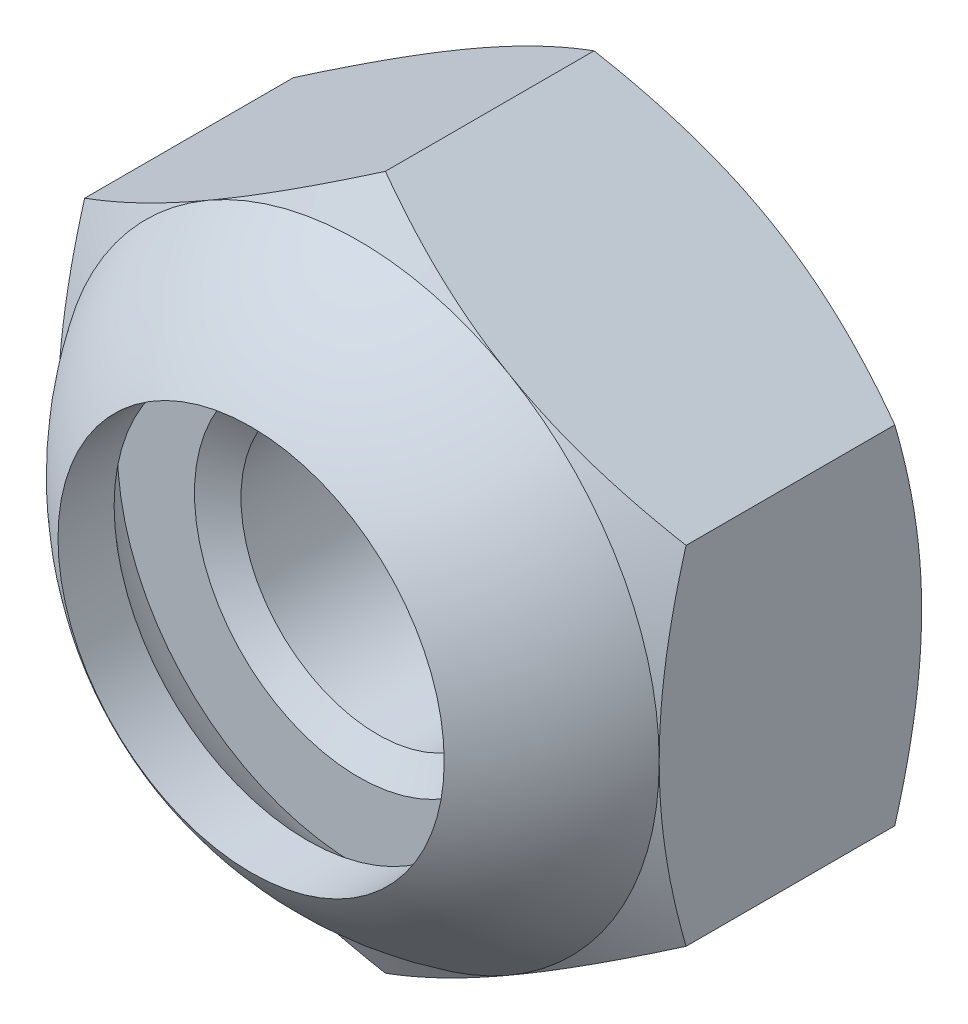
ISO-10303-21;
HEADER;
FILE_DESCRIPTION(('STEP AP214'),'2;1');
FILE_NAME('part.step','',(''),(''),'','','');
FILE_SCHEMA(('AUTOMOTIVE_DESIGN { 1 0 10303 214 1 1 1 1 }'));
ENDSEC;
DATA;
#1=APPLICATION_CONTEXT('core data for automotive mechanical design processes');
#2=APPLICATION_PROTOCOL_DEFINITION('international standard','automotive_design',2000,#1);
#3=PRODUCT_CONTEXT('',#1,'mechanical');
#4=PRODUCT('Part','Part','',(#3));
#5=PRODUCT_RELATED_PRODUCT_CATEGORY('part','',(#4));
#6=PRODUCT_DEFINITION_FORMATION('','',#4);
#7=PRODUCT_DEFINITION_CONTEXT('part definition',#1,'design');
#8=PRODUCT_DEFINITION('design','',#6,#7);
#9=PRODUCT_DEFINITION_SHAPE('','',#8);
#10=(LENGTH_UNIT() NAMED_UNIT(*) SI_UNIT(.MILLI.,.METRE.));
#11=(NAMED_UNIT(*) PLANE_ANGLE_UNIT() SI_UNIT($,.RADIAN.));
#12=(NAMED_UNIT(*) SI_UNIT($,.STERADIAN.) SOLID_ANGLE_UNIT());
#13=UNCERTAINTY_MEASURE_WITH_UNIT(LENGTH_MEASURE(1.E-05),#10,'distance_accuracy_value','');
#14=(GEOMETRIC_REPRESENTATION_CONTEXT(3) GLOBAL_UNCERTAINTY_ASSIGNED_CONTEXT((#13)) GLOBAL_UNIT_ASSIGNED_CONTEXT((#10,
#11,#12)) REPRESENTATION_CONTEXT('',''));
#15=CARTESIAN_POINT('',(0.,0.,0.));
#16=DIRECTION('',(0.,0.,1.));
#17=DIRECTION('',(1.,0.,0.));
#18=AXIS2_PLACEMENT_3D('',#15,#16,#17);
#19=CARTESIAN_POINT('',(0.,3.17542648054295,0.));
#20=DIRECTION('',(0.,0.,-1.));
#21=DIRECTION('',(-1.,0.,0.));
#22=AXIS2_PLACEMENT_3D('',#19,#20,#21);
#23=PLANE('',#22);
#24=CARTESIAN_POINT('',(0.,0.,0.));
#25=DIRECTION('',(0.,0.,1.));
#26=DIRECTION('',(1.,0.,0.));
#27=AXIS2_PLACEMENT_3D('',#24,#25,#26);
#28=CIRCLE('',#27,1.5);
#29=CARTESIAN_POINT('',(1.5,0.,0.));
#30=VERTEX_POINT('',#29);
#31=EDGE_CURVE('E266',#30,#30,#28,.T.);
#32=ORIENTED_EDGE('',*,*,#31,.F.);
#33=EDGE_LOOP('',(#32));
#34=FACE_BOUND('',#33,.T.);
#35=CARTESIAN_POINT('',(0.,0.,0.));
#36=DIRECTION('',(0.,0.,-1.));
#37=DIRECTION('',(-1.,0.,0.));
#38=AXIS2_PLACEMENT_3D('',#35,#36,#37);
#39=CIRCLE('',#38,2.20459510089715);
#40=CARTESIAN_POINT('',(-2.20459510089715,0.,0.));
#41=VERTEX_POINT('',#40);
#42=EDGE_CURVE('E11',#41,#41,#39,.T.);
#43=ORIENTED_EDGE('',*,*,#42,.F.);
#44=EDGE_LOOP('',(#43));
#45=FACE_BOUND('',#44,.T.);
#46=ADVANCED_FACE('F36',(#34,#45),#23,.F.);
#47=CARTESIAN_POINT('',(0.,0.,-2.4));
#48=DIRECTION('',(0.,0.,1.));
#49=DIRECTION('',(1.,0.,0.));
#50=AXIS2_PLACEMENT_3D('',#47,#48,#49);
#51=CYLINDRICAL_SURFACE('',#50,1.25);
#52=CARTESIAN_POINT('',(0.,0.,-0.175051884552417));
#53=DIRECTION('',(0.,0.,1.));
#54=DIRECTION('',(1.,0.,0.));
#55=AXIS2_PLACEMENT_3D('',#52,#53,#54);
#56=CIRCLE('',#55,1.25);
#57=CARTESIAN_POINT('',(1.25,0.,-0.175051884552417));
#58=VERTEX_POINT('',#57);
#59=EDGE_CURVE('E263',#58,#58,#56,.F.);
#60=ORIENTED_EDGE('',*,*,#59,.F.);
#61=EDGE_LOOP('',(#60));
#62=FACE_BOUND('',#61,.T.);
#63=CARTESIAN_POINT('',(0.,0.,-2.19954811544758));
#64=DIRECTION('',(0.,0.,-1.));
#65=DIRECTION('',(-1.,0.,0.));
#66=AXIS2_PLACEMENT_3D('',#63,#64,#65);
#67=CIRCLE('',#66,1.25);
#68=CARTESIAN_POINT('',(-1.25,0.,-2.19954811544758));
#69=VERTEX_POINT('',#68);
#70=EDGE_CURVE('E269',#69,#69,#67,.F.);
#71=ORIENTED_EDGE('',*,*,#70,.F.);
#72=EDGE_LOOP('',(#71));
#73=FACE_BOUND('',#72,.T.);
#74=ADVANCED_FACE('F301',(#62,#73),#51,.F.);
#75=CARTESIAN_POINT('',(0.,3.17542648054295,-2.4));
#76=DIRECTION('',(0.,0.,-1.));
#77=DIRECTION('',(-1.,0.,0.));
#78=AXIS2_PLACEMENT_3D('',#75,#76,#77);
#79=PLANE('',#78);
#80=CARTESIAN_POINT('',(0.,0.,-2.4));
#81=DIRECTION('',(0.,0.,-1.));
#82=DIRECTION('',(-1.,0.,0.));
#83=AXIS2_PLACEMENT_3D('',#80,#81,#82);
#84=CIRCLE('',#83,2.75);
#85=CARTESIAN_POINT('',(-2.75,0.,-2.4));
#86=VERTEX_POINT('',#85);
#87=CARTESIAN_POINT('',(-1.37500000000002,-2.3815698604072,-2.4));
#88=VERTEX_POINT('',#87);
#89=EDGE_CURVE('E147',#86,#88,#84,.F.);
#90=ORIENTED_EDGE('',*,*,#89,.F.);
#91=CARTESIAN_POINT('',(-1.37500000000001,2.3815698604072,-2.4));
#92=VERTEX_POINT('',#91);
#93=EDGE_CURVE('E246',#92,#86,#84,.F.);
#94=ORIENTED_EDGE('',*,*,#93,.F.);
#95=CARTESIAN_POINT('',(1.37500000000002,2.38156986040719,-2.4));
#96=VERTEX_POINT('',#95);
#97=EDGE_CURVE('E261',#96,#92,#84,.F.);
#98=ORIENTED_EDGE('',*,*,#97,.F.);
#99=CARTESIAN_POINT('',(0.,0.,-2.4));
#100=DIRECTION('',(0.,0.,1.));
#101=DIRECTION('',(1.,0.,0.));
#102=AXIS2_PLACEMENT_3D('',#99,#100,#101);
#103=CIRCLE('',#102,2.75);
#104=CARTESIAN_POINT('',(2.75,0.,-2.4));
#105=VERTEX_POINT('',#104);
#106=EDGE_CURVE('E215',#105,#96,#103,.T.);
#107=ORIENTED_EDGE('',*,*,#106,.F.);
#108=CARTESIAN_POINT('',(1.375,-2.3815698604072,-2.4));
#109=VERTEX_POINT('',#108);
#110=EDGE_CURVE('E421',#109,#105,#84,.F.);
#111=ORIENTED_EDGE('',*,*,#110,.F.);
#112=EDGE_CURVE('E414',#88,#109,#84,.F.);
#113=ORIENTED_EDGE('',*,*,#112,.F.);
#114=EDGE_LOOP('',(#90,#94,#98,#107,#111,#113));
#115=FACE_BOUND('',#114,.T.);
#116=CARTESIAN_POINT('',(0.,0.,-2.4));
#117=DIRECTION('',(0.,0.,-1.));
#118=DIRECTION('',(-1.,0.,0.));
#119=AXIS2_PLACEMENT_3D('',#116,#117,#118);
#120=CIRCLE('',#119,1.5);
#121=CARTESIAN_POINT('',(-1.5,0.,-2.4));
#122=VERTEX_POINT('',#121);
#123=EDGE_CURVE('E267',#122,#122,#120,.F.);
#124=ORIENTED_EDGE('',*,*,#123,.T.);
#125=EDGE_LOOP('',(#124));
#126=FACE_BOUND('',#125,.T.);
#127=ADVANCED_FACE('F223',(#115,#126),#79,.T.);
#128=CARTESIAN_POINT('',(0.,3.17542648054295,-2.4));
#129=DIRECTION('',(-0.500000000000004,0.866025403784436,0.));
#130=DIRECTION('',(-0.866025403784437,-0.500000000000004,0.));
#131=AXIS2_PLACEMENT_3D('',#128,#129,#130);
#132=PLANE('',#131);
#133=DIRECTION('',(0.,0.,1.));
#134=VECTOR('',#133,1.);
#135=CARTESIAN_POINT('',(-2.75,1.58771324027146,-2.4));
#136=LINE('',#135,#134);
#137=CARTESIAN_POINT('',(-2.75,1.58771324027149,-2.15437990693813));
#138=VERTEX_POINT('',#137);
#139=CARTESIAN_POINT('',(-2.75,1.58771324027146,-0.245620093061863));
#140=VERTEX_POINT('',#139);
#141=EDGE_CURVE('E257',#138,#140,#136,.T.);
#142=ORIENTED_EDGE('',*,*,#141,.T.);
#143=CARTESIAN_POINT('',(-2.7502,1.58759777021762,-0.245686763364762));
#144=CARTESIAN_POINT('',(-2.62935077934009,1.65737010029698,-0.205387662249264));
#145=CARTESIAN_POINT('',(-2.50745839737737,1.72774469983532,-0.168736902597662));
#146=CARTESIAN_POINT('',(-2.26156287327211,1.86971254687002,-0.1047621829698));
#147=CARTESIAN_POINT('',(-2.13755536142614,1.94130831721582,-0.0774608556744958));
#148=CARTESIAN_POINT('',(-1.89107720202406,2.08361254889598,-0.0349617452941147));
#149=CARTESIAN_POINT('',(-1.76864448141258,2.15429911309863,-0.0194811186224557));
#150=CARTESIAN_POINT('',(-1.52320285763109,2.29600490065922,-0.000999397369938647));
#151=CARTESIAN_POINT('',(-1.40019484676709,2.36702360884403,0.00201700053740192));
#152=CARTESIAN_POINT('',(-1.17034121338921,2.49972966594897,-0.0042531454285456));
#153=CARTESIAN_POINT('',(-1.06346120874598,2.56143686540072,-0.0120001542767017));
#154=CARTESIAN_POINT('',(-0.850397532665248,2.68444923614047,-0.0365551810643555));
#155=CARTESIAN_POINT('',(-0.744214598351108,2.74575398185008,-0.0533715896505721));
#156=CARTESIAN_POINT('',(-0.530711510606812,2.86902004703207,-0.0954119223459602));
#157=CARTESIAN_POINT('',(-0.423418383857139,2.93096576264319,-0.120814080687236));
#158=CARTESIAN_POINT('',(-0.210432520715941,3.05393320806134,-0.178467225839989));
#159=CARTESIAN_POINT('',(-0.104737054973339,3.11495651365996,-0.210704663298991));
#160=CARTESIAN_POINT('',(0.000200000000009052,3.17554195059679,-0.245686763364771));
#161=B_SPLINE_CURVE_WITH_KNOTS('',3,(#143,#144,#145,#146,#147,#148,#149,#150,#151,#152,#153,
#154,#155,#156,#157,#158,#159,#160),.UNSPECIFIED.,.F.,.F.,(4,2,2,2,2,2,2,2,4),(0.,
0.435912828725888,0.872873557116333,1.29901931904672,1.72464171213574,2.09526089052938,
2.46622354066375,2.84541551798559,3.22386274754526),.UNSPECIFIED.);
#162=CARTESIAN_POINT('',(-1.37500000000001,2.3815698604072,0.));
#163=VERTEX_POINT('',#162);
#164=EDGE_CURVE('E60',#140,#163,#161,.T.);
#165=ORIENTED_EDGE('',*,*,#164,.T.);
#166=CARTESIAN_POINT('',(0.,3.17542648054295,-0.245620093061873));
#167=VERTEX_POINT('',#166);
#168=EDGE_CURVE('E205',#163,#167,#161,.T.);
#169=ORIENTED_EDGE('',*,*,#168,.T.);
#170=DIRECTION('',(0.,0.,1.));
#171=VECTOR('',#170,1.);
#172=CARTESIAN_POINT('',(0.,3.17542648054295,-2.4));
#173=LINE('',#172,#171);
#174=CARTESIAN_POINT('',(0.,3.17542648054295,-2.15437990693813));
#175=VERTEX_POINT('',#174);
#176=EDGE_CURVE('E243',#175,#167,#173,.T.);
#177=ORIENTED_EDGE('',*,*,#176,.F.);
#178=CARTESIAN_POINT('',(-2.7502,1.58759777021762,-2.15431323663524));
#179=CARTESIAN_POINT('',(-2.62935077934009,1.65737010029698,-2.19461233775074));
#180=CARTESIAN_POINT('',(-2.50745839737737,1.72774469983532,-2.23126309740234));
#181=CARTESIAN_POINT('',(-2.26156287327211,1.86971254687002,-2.2952378170302));
#182=CARTESIAN_POINT('',(-2.13755536142614,1.94130831721582,-2.3225391443255));
#183=CARTESIAN_POINT('',(-1.89107720202406,2.08361254889598,-2.36503825470588));
#184=CARTESIAN_POINT('',(-1.76864448141258,2.15429911309863,-2.38051888137754));
#185=CARTESIAN_POINT('',(-1.52320285763109,2.29600490065922,-2.39900060263006));
#186=CARTESIAN_POINT('',(-1.40019484676709,2.36702360884403,-2.4020170005374));
#187=CARTESIAN_POINT('',(-1.17034121338921,2.49972966594897,-2.39574685457145));
#188=CARTESIAN_POINT('',(-1.06346120874598,2.56143686540072,-2.3879998457233));
#189=CARTESIAN_POINT('',(-0.850397532665248,2.68444923614047,-2.36344481893564));
#190=CARTESIAN_POINT('',(-0.744214598351108,2.74575398185008,-2.34662841034943));
#191=CARTESIAN_POINT('',(-0.530711510606812,2.86902004703207,-2.30458807765404));
#192=CARTESIAN_POINT('',(-0.423418383857139,2.93096576264319,-2.27918591931276));
#193=CARTESIAN_POINT('',(-0.210432520715941,3.05393320806134,-2.22153277416001));
#194=CARTESIAN_POINT('',(-0.104737054973339,3.11495651365996,-2.18929533670101));
#195=CARTESIAN_POINT('',(0.00020000000000905,3.17554195059679,-2.15431323663523));
#196=B_SPLINE_CURVE_WITH_KNOTS('',3,(#178,#179,#180,#181,#182,#183,#184,#185,#186,#187,#188,
#189,#190,#191,#192,#193,#194,#195),.UNSPECIFIED.,.F.,.F.,(4,2,2,2,2,2,2,2,4),(0.,
0.435912828725889,0.872873557116333,1.29901931904672,1.72464171213574,2.09526089052938,
2.46622354066375,2.84541551798559,3.22386274754526),.UNSPECIFIED.);
#197=EDGE_CURVE('E259',#92,#175,#196,.T.);
#198=ORIENTED_EDGE('',*,*,#197,.F.);
#199=EDGE_CURVE('E237',#138,#92,#196,.T.);
#200=ORIENTED_EDGE('',*,*,#199,.F.);
#201=EDGE_LOOP('',(#142,#165,#169,#177,#198,#200));
#202=FACE_BOUND('',#201,.T.);
#203=ADVANCED_FACE('F38',(#202),#132,.T.);
#204=CARTESIAN_POINT('',(2.75,1.58771324027145,-2.4));
#205=DIRECTION('',(0.500000000000009,0.866025403784433,0.));
#206=DIRECTION('',(-0.866025403784434,0.500000000000009,0.));
#207=AXIS2_PLACEMENT_3D('',#204,#205,#206);
#208=PLANE('',#207);
#209=ORIENTED_EDGE('',*,*,#176,.T.);
#210=CARTESIAN_POINT('',(-0.000199999999990853,3.17554195059679,-0.245686763364771));
#211=CARTESIAN_POINT('',(0.120649220659915,3.10576962051743,-0.205387662249272));
#212=CARTESIAN_POINT('',(0.242541602622642,3.03539502097909,-0.16873690259767));
#213=CARTESIAN_POINT('',(0.488437126727901,2.89342717394439,-0.104762182969806));
#214=CARTESIAN_POINT('',(0.612444638573863,2.82183140359859,-0.0774608556745011));
#215=CARTESIAN_POINT('',(0.858922797975952,2.67952717191842,-0.0349617452941182));
#216=CARTESIAN_POINT('',(0.981355518587425,2.60884060771577,-0.0194811186224581));
#217=CARTESIAN_POINT('',(1.22679714236892,2.46713482015518,-0.000999397369939154));
#218=CARTESIAN_POINT('',(1.34980515323292,2.39611611197037,0.00201700053740218));
#219=CARTESIAN_POINT('',(1.5796587866108,2.26341005486543,-0.00425314542854392));
#220=CARTESIAN_POINT('',(1.68653879125403,2.20170285541367,-0.0120001542766992));
#221=CARTESIAN_POINT('',(1.89960246733476,2.07869048467393,-0.0365551810643514));
#222=CARTESIAN_POINT('',(2.00578540164889,2.01738573896432,-0.053371589650567));
#223=CARTESIAN_POINT('',(2.21928848939319,1.89411967378233,-0.0954119223459534));
#224=CARTESIAN_POINT('',(2.32658161614286,1.83217395817121,-0.120814080687228));
#225=CARTESIAN_POINT('',(2.53956747928405,1.70920651275305,-0.17846722583998));
#226=CARTESIAN_POINT('',(2.64526294502666,1.64818320715444,-0.210704663298981));
#227=CARTESIAN_POINT('',(2.7502,1.58759777021761,-0.245686763364759));
#228=B_SPLINE_CURVE_WITH_KNOTS('',3,(#210,#211,#212,#213,#214,#215,#216,#217,#218,#219,#220,
#221,#222,#223,#224,#225,#226,#227),.UNSPECIFIED.,.F.,.F.,(4,2,2,2,2,2,2,2,4),(0.,
0.435912828725891,0.872873557116338,1.29901931904672,1.72464171213575,2.09526089052939,
2.46622354066375,2.84541551798559,3.22386274754526),.UNSPECIFIED.);
#229=CARTESIAN_POINT('',(1.37500000000002,2.38156986040719,0.));
#230=VERTEX_POINT('',#229);
#231=EDGE_CURVE('E214',#167,#230,#228,.T.);
#232=ORIENTED_EDGE('',*,*,#231,.T.);
#233=CARTESIAN_POINT('',(2.75,1.58771324027149,-0.245620093061873));
#234=VERTEX_POINT('',#233);
#235=EDGE_CURVE('E206',#230,#234,#228,.T.);
#236=ORIENTED_EDGE('',*,*,#235,.T.);
#237=DIRECTION('',(0.,0.,1.));
#238=VECTOR('',#237,1.);
#239=CARTESIAN_POINT('',(2.75,1.58771324027145,-2.4));
#240=LINE('',#239,#238);
#241=CARTESIAN_POINT('',(2.75,1.58771324027149,-2.15437990693813));
#242=VERTEX_POINT('',#241);
#243=EDGE_CURVE('E247',#242,#234,#240,.T.);
#244=ORIENTED_EDGE('',*,*,#243,.F.);
#245=CARTESIAN_POINT('',(-0.000199999999990853,3.17554195059679,-2.15431323663523));
#246=CARTESIAN_POINT('',(0.120649220659915,3.10576962051743,-2.19461233775073));
#247=CARTESIAN_POINT('',(0.242541602622642,3.03539502097909,-2.23126309740233));
#248=CARTESIAN_POINT('',(0.488437126727901,2.89342717394439,-2.29523781703019));
#249=CARTESIAN_POINT('',(0.612444638573863,2.82183140359859,-2.3225391443255));
#250=CARTESIAN_POINT('',(0.858922797975952,2.67952717191842,-2.36503825470588));
#251=CARTESIAN_POINT('',(0.981355518587425,2.60884060771577,-2.38051888137754));
#252=CARTESIAN_POINT('',(1.22679714236892,2.46713482015518,-2.39900060263006));
#253=CARTESIAN_POINT('',(1.34980515323292,2.39611611197037,-2.4020170005374));
#254=CARTESIAN_POINT('',(1.5796587866108,2.26341005486543,-2.39574685457146));
#255=CARTESIAN_POINT('',(1.68653879125403,2.20170285541367,-2.3879998457233));
#256=CARTESIAN_POINT('',(1.89960246733476,2.07869048467393,-2.36344481893565));
#257=CARTESIAN_POINT('',(2.00578540164889,2.01738573896432,-2.34662841034943));
#258=CARTESIAN_POINT('',(2.21928848939319,1.89411967378233,-2.30458807765405));
#259=CARTESIAN_POINT('',(2.32658161614286,1.83217395817121,-2.27918591931277));
#260=CARTESIAN_POINT('',(2.53956747928406,1.70920651275305,-2.22153277416002));
#261=CARTESIAN_POINT('',(2.64526294502666,1.64818320715444,-2.18929533670102));
#262=CARTESIAN_POINT('',(2.7502,1.58759777021761,-2.15431323663524));
#263=B_SPLINE_CURVE_WITH_KNOTS('',3,(#245,#246,#247,#248,#249,#250,#251,#252,#253,#254,#255,
#256,#257,#258,#259,#260,#261,#262),.UNSPECIFIED.,.F.,.F.,(4,2,2,2,2,2,2,2,4),(0.,
0.435912828725891,0.872873557116338,1.29901931904672,1.72464171213575,2.09526089052939,
2.46622354066375,2.84541551798559,3.22386274754526),.UNSPECIFIED.);
#264=EDGE_CURVE('E228',#96,#242,#263,.T.);
#265=ORIENTED_EDGE('',*,*,#264,.F.);
#266=EDGE_CURVE('E235',#175,#96,#263,.T.);
#267=ORIENTED_EDGE('',*,*,#266,.F.);
#268=EDGE_LOOP('',(#209,#232,#236,#244,#265,#267));
#269=FACE_BOUND('',#268,.T.);
#270=ADVANCED_FACE('F217',(#269),#208,.T.);
#271=CARTESIAN_POINT('',(2.75,1.58771324027145,-2.4));
#272=DIRECTION('',(-1.,0.,0.));
#273=DIRECTION('',(0.,0.,1.));
#274=AXIS2_PLACEMENT_3D('',#271,#272,#273);
#275=PLANE('',#274);
#276=CARTESIAN_POINT('',(2.75,-4.2108494930968,-1.31594843960298));
#277=CARTESIAN_POINT('',(2.75,-4.09010894214094,-1.25759993615228));
#278=CARTESIAN_POINT('',(2.75,-3.96908292065513,-1.19983146511762));
#279=CARTESIAN_POINT('',(2.75,-3.72630558284848,-1.08578603842309));
#280=CARTESIAN_POINT('',(2.75,-3.60455414536204,-1.02950934100251));
#281=CARTESIAN_POINT('',(2.75,-3.35951393034358,-0.91848244335279));
#282=CARTESIAN_POINT('',(2.75,-3.2362203423644,-0.86374282160587));
#283=CARTESIAN_POINT('',(2.75,-2.98861980138747,-0.756614777476483));
#284=CARTESIAN_POINT('',(2.75,-2.86431290161186,-0.704226232536791));
#285=CARTESIAN_POINT('',(2.75,-2.61294485887175,-0.601803572146148));
#286=CARTESIAN_POINT('',(2.75,-2.48586863815658,-0.551806257898417));
#287=CARTESIAN_POINT('',(2.75,-2.23021732171544,-0.455727408784622));
#288=CARTESIAN_POINT('',(2.75,-2.10164206103367,-0.409646309576991));
#289=CARTESIAN_POINT('',(2.75,-1.8430521879947,-0.322638077046248));
#290=CARTESIAN_POINT('',(2.75,-1.71304130052586,-0.281699986413904));
#291=CARTESIAN_POINT('',(2.75,-1.45117125062151,-0.206307307624361));
#292=CARTESIAN_POINT('',(2.75,-1.31931268690205,-0.171850669152779));
#293=CARTESIAN_POINT('',(2.75,-1.05365722480015,-0.111093671530913));
#294=CARTESIAN_POINT('',(2.75,-0.919859820217618,-0.0847954840951296));
#295=CARTESIAN_POINT('',(2.75,-0.650651874037407,-0.0421260371966173));
#296=CARTESIAN_POINT('',(2.75,-0.51524133101362,-0.0257547865105482));
#297=CARTESIAN_POINT('',(2.75,-0.244373242869234,-0.00438749654024083));
#298=CARTESIAN_POINT('',(2.75,-0.108921526377156,0.000680556773213286));
#299=CARTESIAN_POINT('',(2.75,0.161887058855113,-0.000827795632673346));
#300=CARTESIAN_POINT('',(2.75,0.297243943089621,-0.00740117868555447));
#301=CARTESIAN_POINT('',(2.75,0.528385436717521,-0.0281041300468438));
#302=CARTESIAN_POINT('',(2.75,0.624425050137477,-0.0395376410301878));
#303=CARTESIAN_POINT('',(2.75,0.815762399811515,-0.0675217196133493));
#304=CARTESIAN_POINT('',(2.75,0.911060016631936,-0.08407309422768));
#305=CARTESIAN_POINT('',(2.75,1.19576218748913,-0.14053536127828));
#306=CARTESIAN_POINT('',(2.75,1.38383224738492,-0.187239859417288));
#307=CARTESIAN_POINT('',(2.75,1.6652504894748,-0.26779249703057));
#308=CARTESIAN_POINT('',(2.75,1.76006556248553,-0.296803334995491));
#309=CARTESIAN_POINT('',(2.75,1.9487060938221,-0.357695648906576));
#310=CARTESIAN_POINT('',(2.75,2.0425321855369,-0.389575144878491));
#311=CARTESIAN_POINT('',(2.75,2.22880240354978,-0.455541418186435));
#312=CARTESIAN_POINT('',(2.75,2.32125133588445,-0.489614761455518));
#313=CARTESIAN_POINT('',(2.75,2.50543192042622,-0.559761368231093));
#314=CARTESIAN_POINT('',(2.75,2.59716326539572,-0.595835440037301));
#315=CARTESIAN_POINT('',(2.75,2.68856293053338,-0.632712441997466));
#316=B_SPLINE_CURVE_WITH_KNOTS('',3,(#276,#277,#278,#279,#280,#281,#282,#283,#284,#285,#286,
#287,#288,#289,#290,#291,#292,#293,#294,#295,#296,#297,#298,#299,#300,#301,#302,#303,#304,#305,
#306,#307,#308,#309,#310,#311,#312,#313,#314,#315),.UNSPECIFIED.,.F.,.F.,(4,2,2,2,2,2,2,2,2,2,2,
2,2,2,2,2,2,2,2,4),(0.,0.402305607365938,0.804680408537001,1.20935783819119,1.61401414820819,
2.02363838185771,2.4333081245735,2.84208969479602,3.25074173456638,3.65950246109146,
4.06826354901186,4.47441284024653,4.88045669141175,5.17046846817548,5.46052599902454,
6.04107275309883,6.33851131304661,6.63574613017454,6.9313079100579,7.2269899800482),.UNSPECIFIED.);
#317=CARTESIAN_POINT('',(2.74999999999999,-1.58771324027152,-0.245620093061873));
#318=VERTEX_POINT('',#317);
#319=CARTESIAN_POINT('',(2.75,0.,0.));
#320=VERTEX_POINT('',#319);
#321=EDGE_CURVE('E193',#318,#320,#316,.T.);
#322=ORIENTED_EDGE('',*,*,#321,.F.);
#323=DIRECTION('',(0.,0.,1.));
#324=VECTOR('',#323,1.);
#325=CARTESIAN_POINT('',(2.75,-1.58771324027151,-2.4));
#326=LINE('',#325,#324);
#327=CARTESIAN_POINT('',(2.74999999999999,-1.58771324027152,-2.15437990693813));
#328=VERTEX_POINT('',#327);
#329=EDGE_CURVE('E250',#328,#318,#326,.T.);
#330=ORIENTED_EDGE('',*,*,#329,.F.);
#331=CARTESIAN_POINT('',(2.75,-4.2108494930968,-1.08405156039702));
#332=CARTESIAN_POINT('',(2.75,-4.09010894214094,-1.14240006384772));
#333=CARTESIAN_POINT('',(2.75,-3.96908292065513,-1.20016853488238));
#334=CARTESIAN_POINT('',(2.75,-3.72630558284848,-1.31421396157691));
#335=CARTESIAN_POINT('',(2.75,-3.60455414536204,-1.37049065899749));
#336=CARTESIAN_POINT('',(2.75,-3.35951393034358,-1.48151755664721));
#337=CARTESIAN_POINT('',(2.75,-3.2362203423644,-1.53625717839413));
#338=CARTESIAN_POINT('',(2.75,-2.98861980138747,-1.64338522252352));
#339=CARTESIAN_POINT('',(2.75,-2.86431290161186,-1.69577376746321));
#340=CARTESIAN_POINT('',(2.75,-2.61294485887176,-1.79819642785385));
#341=CARTESIAN_POINT('',(2.75,-2.48586863815658,-1.84819374210158));
#342=CARTESIAN_POINT('',(2.75,-2.23021732171544,-1.94427259121538));
#343=CARTESIAN_POINT('',(2.75,-2.10164206103367,-1.99035369042301));
#344=CARTESIAN_POINT('',(2.75,-1.8430521879947,-2.07736192295375));
#345=CARTESIAN_POINT('',(2.75,-1.71304130052586,-2.1183000135861));
#346=CARTESIAN_POINT('',(2.75,-1.45117125062151,-2.19369269237564));
#347=CARTESIAN_POINT('',(2.75,-1.31931268690205,-2.22814933084722));
#348=CARTESIAN_POINT('',(2.75,-1.05365722480015,-2.28890632846909));
#349=CARTESIAN_POINT('',(2.75,-0.919859820217618,-2.31520451590487));
#350=CARTESIAN_POINT('',(2.75,-0.650651874037407,-2.35787396280338));
#351=CARTESIAN_POINT('',(2.75,-0.515241331013619,-2.37424521348945));
#352=CARTESIAN_POINT('',(2.75,-0.244373242869234,-2.39561250345976));
#353=CARTESIAN_POINT('',(2.75,-0.108921526377155,-2.40068055677321));
#354=CARTESIAN_POINT('',(2.75,0.161887058855114,-2.39917220436733));
#355=CARTESIAN_POINT('',(2.75,0.297243943089621,-2.39259882131445));
#356=CARTESIAN_POINT('',(2.75,0.528385436717521,-2.37189586995316));
#357=CARTESIAN_POINT('',(2.75,0.624425050137477,-2.36046235896981));
#358=CARTESIAN_POINT('',(2.75,0.815762399811515,-2.33247828038665));
#359=CARTESIAN_POINT('',(2.75,0.911060016631935,-2.31592690577232));
#360=CARTESIAN_POINT('',(2.75,1.19576218748913,-2.25946463872172));
#361=CARTESIAN_POINT('',(2.75,1.38383224738492,-2.21276014058271));
#362=CARTESIAN_POINT('',(2.75,1.6652504894748,-2.13220750296943));
#363=CARTESIAN_POINT('',(2.75,1.76006556248553,-2.10319666500451));
#364=CARTESIAN_POINT('',(2.75,1.9487060938221,-2.04230435109342));
#365=CARTESIAN_POINT('',(2.75,2.0425321855369,-2.01042485512151));
#366=CARTESIAN_POINT('',(2.75,2.22880240354978,-1.94445858181357));
#367=CARTESIAN_POINT('',(2.75,2.32125133588445,-1.91038523854448));
#368=CARTESIAN_POINT('',(2.75,2.50543192042622,-1.84023863176891));
#369=CARTESIAN_POINT('',(2.75,2.59716326539572,-1.8041645599627));
#370=CARTESIAN_POINT('',(2.75,2.68856293053338,-1.76728755800253));
#371=B_SPLINE_CURVE_WITH_KNOTS('',3,(#331,#332,#333,#334,#335,#336,#337,#338,#339,#340,#341,
#342,#343,#344,#345,#346,#347,#348,#349,#350,#351,#352,#353,#354,#355,#356,#357,#358,#359,#360,
#361,#362,#363,#364,#365,#366,#367,#368,#369,#370),.UNSPECIFIED.,.F.,.F.,(4,2,2,2,2,2,2,2,2,2,2,
2,2,2,2,2,2,2,2,4),(0.,0.402305607365938,0.804680408537,1.20935783819119,1.61401414820819,
2.02363838185771,2.4333081245735,2.84208969479602,3.25074173456638,3.65950246109146,
4.06826354901186,4.47441284024653,4.88045669141175,5.17046846817548,5.46052599902454,
6.04107275309883,6.33851131304661,6.63574613017454,6.9313079100579,7.2269899800482),.UNSPECIFIED.);
#372=EDGE_CURVE('E401',#328,#105,#371,.T.);
#373=ORIENTED_EDGE('',*,*,#372,.T.);
#374=EDGE_CURVE('E236',#105,#242,#371,.T.);
#375=ORIENTED_EDGE('',*,*,#374,.T.);
#376=ORIENTED_EDGE('',*,*,#243,.T.);
#377=EDGE_CURVE('E204',#320,#234,#316,.T.);
#378=ORIENTED_EDGE('',*,*,#377,.F.);
#379=EDGE_LOOP('',(#322,#330,#373,#375,#376,#378));
#380=FACE_BOUND('',#379,.T.);
#381=ADVANCED_FACE('F221',(#380),#275,.F.);
#382=CARTESIAN_POINT('',(0.,-3.17542648054299,-2.4));
#383=DIRECTION('',(0.500000000000002,-0.866025403784438,0.));
#384=DIRECTION('',(0.866025403784438,0.500000000000002,0.));
#385=AXIS2_PLACEMENT_3D('',#382,#383,#384);
#386=PLANE('',#385);
#387=ORIENTED_EDGE('',*,*,#329,.T.);
#388=CARTESIAN_POINT('',(2.7502,-1.58759777021767,-0.245686763364776));
#389=CARTESIAN_POINT('',(2.6293507793401,-1.65737010029702,-0.205387662249279));
#390=CARTESIAN_POINT('',(2.50745839737737,-1.72774469983537,-0.168736902597678));
#391=CARTESIAN_POINT('',(2.26156287327211,-1.86971254687006,-0.104762182969816));
#392=CARTESIAN_POINT('',(2.13755536142614,-1.94130831721587,-0.0774608556745132));
#393=CARTESIAN_POINT('',(1.89107720202405,-2.08361254889603,-0.0349617452941333));
#394=CARTESIAN_POINT('',(1.76864448141258,-2.15429911309868,-0.0194811186224748));
#395=CARTESIAN_POINT('',(1.52320285763108,-2.29600490065927,-0.000999397369959041));
#396=CARTESIAN_POINT('',(1.40019484676708,-2.36702360884408,0.00201700053738056));
#397=CARTESIAN_POINT('',(1.1703412133892,-2.49972966594901,-0.00425314542856851));
#398=CARTESIAN_POINT('',(1.06346120874597,-2.56143686540077,-0.012000154276725));
#399=CARTESIAN_POINT('',(0.850397532665243,-2.68444923614051,-0.0365551810643791));
#400=CARTESIAN_POINT('',(0.744214598351104,-2.74575398185012,-0.0533715896505955));
#401=CARTESIAN_POINT('',(0.530711510606811,-2.86902004703211,-0.0954119223459832));
#402=CARTESIAN_POINT('',(0.42341838385714,-2.93096576264323,-0.120814080687258));
#403=CARTESIAN_POINT('',(0.210432520715946,-3.05393320806138,-0.178467225840011));
#404=CARTESIAN_POINT('',(0.104737054973345,-3.11495651366,-0.210704663299012));
#405=CARTESIAN_POINT('',(-0.000200000000002151,-3.17554195059682,-0.245686763364791));
#406=B_SPLINE_CURVE_WITH_KNOTS('',3,(#388,#389,#390,#391,#392,#393,#394,#395,#396,#397,#398,
#399,#400,#401,#402,#403,#404,#405),.UNSPECIFIED.,.F.,.F.,(4,2,2,2,2,2,2,2,4),(0.,
0.435912828725892,0.872873557116341,1.29901931904673,1.72464171213575,2.09526089052939,
2.46622354066376,2.84541551798558,3.22386274754525),.UNSPECIFIED.);
#407=CARTESIAN_POINT('',(1.375,-2.3815698604072,0.));
#408=VERTEX_POINT('',#407);
#409=EDGE_CURVE('E342',#318,#408,#406,.T.);
#410=ORIENTED_EDGE('',*,*,#409,.T.);
#411=CARTESIAN_POINT('',(0.,-3.17542648054295,-0.245620093061873));
#412=VERTEX_POINT('',#411);
#413=EDGE_CURVE('E186',#408,#412,#406,.T.);
#414=ORIENTED_EDGE('',*,*,#413,.T.);
#415=DIRECTION('',(0.,0.,1.));
#416=VECTOR('',#415,1.);
#417=CARTESIAN_POINT('',(0.,-3.17542648054299,-2.4));
#418=LINE('',#417,#416);
#419=CARTESIAN_POINT('',(0.,-3.17542648054295,-2.15437990693813));
#420=VERTEX_POINT('',#419);
#421=EDGE_CURVE('E253',#420,#412,#418,.T.);
#422=ORIENTED_EDGE('',*,*,#421,.F.);
#423=CARTESIAN_POINT('',(2.7502,-1.58759777021767,-2.15431323663522));
#424=CARTESIAN_POINT('',(2.6293507793401,-1.65737010029702,-2.19461233775072));
#425=CARTESIAN_POINT('',(2.50745839737737,-1.72774469983537,-2.23126309740232));
#426=CARTESIAN_POINT('',(2.26156287327211,-1.86971254687006,-2.29523781703018));
#427=CARTESIAN_POINT('',(2.13755536142614,-1.94130831721587,-2.32253914432549));
#428=CARTESIAN_POINT('',(1.89107720202405,-2.08361254889603,-2.36503825470587));
#429=CARTESIAN_POINT('',(1.76864448141258,-2.15429911309868,-2.38051888137752));
#430=CARTESIAN_POINT('',(1.52320285763108,-2.29600490065927,-2.39900060263004));
#431=CARTESIAN_POINT('',(1.40019484676708,-2.36702360884408,-2.40201700053738));
#432=CARTESIAN_POINT('',(1.1703412133892,-2.49972966594901,-2.39574685457143));
#433=CARTESIAN_POINT('',(1.06346120874597,-2.56143686540077,-2.38799984572327));
#434=CARTESIAN_POINT('',(0.850397532665243,-2.68444923614051,-2.36344481893562));
#435=CARTESIAN_POINT('',(0.744214598351104,-2.74575398185012,-2.3466284103494));
#436=CARTESIAN_POINT('',(0.530711510606811,-2.86902004703211,-2.30458807765402));
#437=CARTESIAN_POINT('',(0.42341838385714,-2.93096576264323,-2.27918591931274));
#438=CARTESIAN_POINT('',(0.210432520715945,-3.05393320806138,-2.22153277415999));
#439=CARTESIAN_POINT('',(0.104737054973345,-3.11495651366,-2.18929533670099));
#440=CARTESIAN_POINT('',(-0.00020000000000216,-3.17554195059682,-2.15431323663521));
#441=B_SPLINE_CURVE_WITH_KNOTS('',3,(#423,#424,#425,#426,#427,#428,#429,#430,#431,#432,#433,
#434,#435,#436,#437,#438,#439,#440),.UNSPECIFIED.,.F.,.F.,(4,2,2,2,2,2,2,2,4),(0.,
0.435912828725892,0.872873557116341,1.29901931904673,1.72464171213575,2.09526089052939,
2.46622354066376,2.84541551798558,3.22386274754525),.UNSPECIFIED.);
#442=EDGE_CURVE('E379',#109,#420,#441,.T.);
#443=ORIENTED_EDGE('',*,*,#442,.F.);
#444=EDGE_CURVE('E400',#328,#109,#441,.T.);
#445=ORIENTED_EDGE('',*,*,#444,.F.);
#446=EDGE_LOOP('',(#387,#410,#414,#422,#443,#445));
#447=FACE_BOUND('',#446,.T.);
#448=ADVANCED_FACE('F387',(#447),#386,.T.);
#449=CARTESIAN_POINT('',(-2.75,-1.58771324027149,-2.4));
#450=DIRECTION('',(-0.500000000000006,-0.866025403784435,0.));
#451=DIRECTION('',(0.866025403784435,-0.500000000000006,0.));
#452=AXIS2_PLACEMENT_3D('',#449,#450,#451);
#453=PLANE('',#452);
#454=ORIENTED_EDGE('',*,*,#421,.T.);
#455=CARTESIAN_POINT('',(0.000199999999997729,-3.17554195059682,-0.245686763364791));
#456=CARTESIAN_POINT('',(-0.12064922065991,-3.10576962051747,-0.205387662249292));
#457=CARTESIAN_POINT('',(-0.242541602622639,-3.03539502097912,-0.168736902597689));
#458=CARTESIAN_POINT('',(-0.488437126727901,-2.89342717394442,-0.104762182969825));
#459=CARTESIAN_POINT('',(-0.612444638573865,-2.82183140359862,-0.0774608556745198));
#460=CARTESIAN_POINT('',(-0.858922797975956,-2.67952717191845,-0.0349617452941368));
#461=CARTESIAN_POINT('',(-0.981355518587431,-2.6088406077158,-0.0194811186224767));
#462=CARTESIAN_POINT('',(-1.22679714236893,-2.46713482015521,-0.000999397369957624));
#463=CARTESIAN_POINT('',(-1.34980515323293,-2.3961161119704,0.00201700053738383));
#464=CARTESIAN_POINT('',(-1.57965878661081,-2.26341005486546,-0.00425314542856253));
#465=CARTESIAN_POINT('',(-1.68653879125404,-2.20170285541371,-0.0120001542767179));
#466=CARTESIAN_POINT('',(-1.89960246733476,-2.07869048467397,-0.0365551810643694));
#467=CARTESIAN_POINT('',(-2.0057854016489,-2.01738573896435,-0.0533715896505844));
#468=CARTESIAN_POINT('',(-2.21928848939319,-1.89411967378237,-0.0954119223459693));
#469=CARTESIAN_POINT('',(-2.32658161614286,-1.83217395817125,-0.120814080687243));
#470=CARTESIAN_POINT('',(-2.53956747928405,-1.7092065127531,-0.178467225839993));
#471=CARTESIAN_POINT('',(-2.64526294502665,-1.64818320715448,-0.210704663298993));
#472=CARTESIAN_POINT('',(-2.7502,-1.58759777021765,-0.24568676336477));
#473=B_SPLINE_CURVE_WITH_KNOTS('',3,(#455,#456,#457,#458,#459,#460,#461,#462,#463,#464,#465,
#466,#467,#468,#469,#470,#471,#472),.UNSPECIFIED.,.F.,.F.,(4,2,2,2,2,2,2,2,4),(0.,
0.435912828725896,0.872873557116347,1.29901931904674,1.72464171213576,2.0952608905294,
2.46622354066376,2.84541551798559,3.22386274754525),.UNSPECIFIED.);
#474=CARTESIAN_POINT('',(-1.37500000000002,-2.3815698604072,0.));
#475=VERTEX_POINT('',#474);
#476=EDGE_CURVE('E153',#412,#475,#473,.T.);
#477=ORIENTED_EDGE('',*,*,#476,.T.);
#478=CARTESIAN_POINT('',(-2.75,-1.58771324027149,-0.245620093061873));
#479=VERTEX_POINT('',#478);
#480=EDGE_CURVE('E144',#475,#479,#473,.T.);
#481=ORIENTED_EDGE('',*,*,#480,.T.);
#482=DIRECTION('',(0.,0.,1.));
#483=VECTOR('',#482,1.);
#484=CARTESIAN_POINT('',(-2.75,-1.58771324027149,-2.4));
#485=LINE('',#484,#483);
#486=CARTESIAN_POINT('',(-2.75,-1.58771324027149,-2.15437990693813));
#487=VERTEX_POINT('',#486);
#488=EDGE_CURVE('E152',#487,#479,#485,.T.);
#489=ORIENTED_EDGE('',*,*,#488,.F.);
#490=CARTESIAN_POINT('',(0.000199999999997729,-3.17554195059682,-2.15431323663521));
#491=CARTESIAN_POINT('',(-0.120649220659909,-3.10576962051747,-2.19461233775071));
#492=CARTESIAN_POINT('',(-0.242541602622639,-3.03539502097912,-2.23126309740231));
#493=CARTESIAN_POINT('',(-0.488437126727901,-2.89342717394442,-2.29523781703017));
#494=CARTESIAN_POINT('',(-0.612444638573865,-2.82183140359862,-2.32253914432548));
#495=CARTESIAN_POINT('',(-0.858922797975956,-2.67952717191845,-2.36503825470586));
#496=CARTESIAN_POINT('',(-0.981355518587431,-2.6088406077158,-2.38051888137752));
#497=CARTESIAN_POINT('',(-1.22679714236893,-2.46713482015521,-2.39900060263004));
#498=CARTESIAN_POINT('',(-1.34980515323293,-2.3961161119704,-2.40201700053738));
#499=CARTESIAN_POINT('',(-1.57965878661081,-2.26341005486546,-2.39574685457144));
#500=CARTESIAN_POINT('',(-1.68653879125404,-2.20170285541371,-2.38799984572328));
#501=CARTESIAN_POINT('',(-1.89960246733476,-2.07869048467397,-2.36344481893563));
#502=CARTESIAN_POINT('',(-2.0057854016489,-2.01738573896435,-2.34662841034941));
#503=CARTESIAN_POINT('',(-2.21928848939319,-1.89411967378237,-2.30458807765403));
#504=CARTESIAN_POINT('',(-2.32658161614286,-1.83217395817125,-2.27918591931276));
#505=CARTESIAN_POINT('',(-2.53956747928405,-1.7092065127531,-2.22153277416001));
#506=CARTESIAN_POINT('',(-2.64526294502665,-1.64818320715448,-2.18929533670101));
#507=CARTESIAN_POINT('',(-2.7502,-1.58759777021765,-2.15431323663523));
#508=B_SPLINE_CURVE_WITH_KNOTS('',3,(#490,#491,#492,#493,#494,#495,#496,#497,#498,#499,#500,
#501,#502,#503,#504,#505,#506,#507),.UNSPECIFIED.,.F.,.F.,(4,2,2,2,2,2,2,2,4),(0.,
0.435912828725896,0.872873557116347,1.29901931904674,1.72464171213576,2.0952608905294,
2.46622354066376,2.84541551798559,3.22386274754525),.UNSPECIFIED.);
#509=EDGE_CURVE('E367',#88,#487,#508,.T.);
#510=ORIENTED_EDGE('',*,*,#509,.F.);
#511=EDGE_CURVE('E378',#420,#88,#508,.T.);
#512=ORIENTED_EDGE('',*,*,#511,.F.);
#513=EDGE_LOOP('',(#454,#477,#481,#489,#510,#512));
#514=FACE_BOUND('',#513,.T.);
#515=ADVANCED_FACE('F384',(#514),#453,.T.);
#516=CARTESIAN_POINT('',(-2.75,1.58771324027146,-2.4));
#517=DIRECTION('',(-1.,0.,0.));
#518=DIRECTION('',(0.,0.,1.));
#519=AXIS2_PLACEMENT_3D('',#516,#517,#518);
#520=PLANE('',#519);
#521=ORIENTED_EDGE('',*,*,#488,.T.);
#522=CARTESIAN_POINT('',(-2.75,-4.21084949309678,-1.31594843960297));
#523=CARTESIAN_POINT('',(-2.75,-4.09010894214092,-1.25759993615227));
#524=CARTESIAN_POINT('',(-2.75,-3.96908292065511,-1.19983146511761));
#525=CARTESIAN_POINT('',(-2.75,-3.72630558284846,-1.08578603842308));
#526=CARTESIAN_POINT('',(-2.75,-3.60455414536202,-1.0295093410025));
#527=CARTESIAN_POINT('',(-2.75,-3.35951393034356,-0.918482443352781));
#528=CARTESIAN_POINT('',(-2.75,-3.23622034236438,-0.86374282160586));
#529=CARTESIAN_POINT('',(-2.75,-2.98861980138745,-0.756614777476474));
#530=CARTESIAN_POINT('',(-2.75,-2.86431290161184,-0.704226232536782));
#531=CARTESIAN_POINT('',(-2.75,-2.61294485887174,-0.601803572146141));
#532=CARTESIAN_POINT('',(-2.75,-2.48586863815656,-0.551806257898409));
#533=CARTESIAN_POINT('',(-2.75,-2.23021732171543,-0.455727408784615));
#534=CARTESIAN_POINT('',(-2.75,-2.10164206103365,-0.409646309576985));
#535=CARTESIAN_POINT('',(-2.75,-1.84305218799469,-0.322638077046242));
#536=CARTESIAN_POINT('',(-2.75,-1.71304130052585,-0.281699986413898));
#537=CARTESIAN_POINT('',(-2.75,-1.45117125062149,-0.206307307624356));
#538=CARTESIAN_POINT('',(-2.75,-1.31931268690204,-0.171850669152774));
#539=CARTESIAN_POINT('',(-2.75,-1.05365722480014,-0.111093671530909));
#540=CARTESIAN_POINT('',(-2.75,-0.919859820217608,-0.0847954840951256));
#541=CARTESIAN_POINT('',(-2.75,-0.650651874037396,-0.0421260371966136));
#542=CARTESIAN_POINT('',(-2.75,-0.51524133101361,-0.0257547865105448));
#543=CARTESIAN_POINT('',(-2.75,-0.244373242869224,-0.00438749654023814));
#544=CARTESIAN_POINT('',(-2.75,-0.108921526377146,0.000680556773215598));
#545=CARTESIAN_POINT('',(-2.75,0.161887058855123,-0.00082779563267165));
#546=CARTESIAN_POINT('',(-2.75,0.29724394308963,-0.00740117868555298));
#547=CARTESIAN_POINT('',(-2.75,0.52838543671753,-0.0281041300468428));
#548=CARTESIAN_POINT('',(-2.75,0.624425050137486,-0.039537641030187));
#549=CARTESIAN_POINT('',(-2.75,0.815762399811525,-0.067521719613349));
#550=CARTESIAN_POINT('',(-2.75,0.911060016631945,-0.0840730942276798));
#551=CARTESIAN_POINT('',(-2.75,1.19576218748914,-0.14053536127828));
#552=CARTESIAN_POINT('',(-2.75,1.38383224738494,-0.187239859417288));
#553=CARTESIAN_POINT('',(-2.75,1.66525048947482,-0.267792497030571));
#554=CARTESIAN_POINT('',(-2.75,1.76006556248554,-0.296803334995493));
#555=CARTESIAN_POINT('',(-2.75,1.94870609382211,-0.357695648906579));
#556=CARTESIAN_POINT('',(-2.75,2.04253218553691,-0.389575144878494));
#557=CARTESIAN_POINT('',(-2.75,2.2288024035498,-0.455541418186437));
#558=CARTESIAN_POINT('',(-2.75,2.32125133588446,-0.489614761455521));
#559=CARTESIAN_POINT('',(-2.75,2.50543192042623,-0.559761368231096));
#560=CARTESIAN_POINT('',(-2.75,2.59716326539573,-0.595835440037304));
#561=CARTESIAN_POINT('',(-2.75,2.6885629305334,-0.63271244199747));
#562=B_SPLINE_CURVE_WITH_KNOTS('',3,(#522,#523,#524,#525,#526,#527,#528,#529,#530,#531,#532,
#533,#534,#535,#536,#537,#538,#539,#540,#541,#542,#543,#544,#545,#546,#547,#548,#549,#550,#551,
#552,#553,#554,#555,#556,#557,#558,#559,#560,#561),.UNSPECIFIED.,.F.,.F.,(4,2,2,2,2,2,2,2,2,2,2,
2,2,2,2,2,2,2,2,4),(0.,0.402305607365938,0.804680408537,1.20935783819118,1.61401414820819,
2.02363838185771,2.43330812457349,2.84208969479601,3.25074173456637,3.65950246109145,
4.06826354901185,4.47441284024652,4.88045669141174,5.17046846817547,5.46052599902453,
6.04107275309882,6.3385113130466,6.63574613017453,6.9313079100579,7.22698998004819),.UNSPECIFIED.);
#563=CARTESIAN_POINT('',(-2.75,0.,0.));
#564=VERTEX_POINT('',#563);
#565=EDGE_CURVE('E137',#479,#564,#562,.T.);
#566=ORIENTED_EDGE('',*,*,#565,.T.);
#567=EDGE_CURVE('E131',#564,#140,#562,.T.);
#568=ORIENTED_EDGE('',*,*,#567,.T.);
#569=ORIENTED_EDGE('',*,*,#141,.F.);
#570=CARTESIAN_POINT('',(-2.75,-4.21084949309678,-1.08405156039703));
#571=CARTESIAN_POINT('',(-2.75,-4.09010894214092,-1.14240006384773));
#572=CARTESIAN_POINT('',(-2.75,-3.96908292065511,-1.20016853488239));
#573=CARTESIAN_POINT('',(-2.75,-3.72630558284846,-1.31421396157692));
#574=CARTESIAN_POINT('',(-2.75,-3.60455414536202,-1.3704906589975));
#575=CARTESIAN_POINT('',(-2.75,-3.35951393034357,-1.48151755664722));
#576=CARTESIAN_POINT('',(-2.75,-3.23622034236438,-1.53625717839414));
#577=CARTESIAN_POINT('',(-2.75,-2.98861980138745,-1.64338522252353));
#578=CARTESIAN_POINT('',(-2.75,-2.86431290161184,-1.69577376746322));
#579=CARTESIAN_POINT('',(-2.75,-2.61294485887174,-1.79819642785386));
#580=CARTESIAN_POINT('',(-2.75,-2.48586863815656,-1.84819374210159));
#581=CARTESIAN_POINT('',(-2.75,-2.23021732171543,-1.94427259121538));
#582=CARTESIAN_POINT('',(-2.75,-2.10164206103365,-1.99035369042301));
#583=CARTESIAN_POINT('',(-2.75,-1.84305218799469,-2.07736192295376));
#584=CARTESIAN_POINT('',(-2.75,-1.71304130052585,-2.1183000135861));
#585=CARTESIAN_POINT('',(-2.75,-1.45117125062149,-2.19369269237564));
#586=CARTESIAN_POINT('',(-2.75,-1.31931268690204,-2.22814933084723));
#587=CARTESIAN_POINT('',(-2.75,-1.05365722480014,-2.28890632846909));
#588=CARTESIAN_POINT('',(-2.75,-0.919859820217607,-2.31520451590487));
#589=CARTESIAN_POINT('',(-2.75,-0.650651874037396,-2.35787396280339));
#590=CARTESIAN_POINT('',(-2.75,-0.515241331013609,-2.37424521348945));
#591=CARTESIAN_POINT('',(-2.75,-0.244373242869224,-2.39561250345976));
#592=CARTESIAN_POINT('',(-2.75,-0.108921526377146,-2.40068055677322));
#593=CARTESIAN_POINT('',(-2.75,0.161887058855123,-2.39917220436733));
#594=CARTESIAN_POINT('',(-2.75,0.29724394308963,-2.39259882131445));
#595=CARTESIAN_POINT('',(-2.75,0.52838543671753,-2.37189586995316));
#596=CARTESIAN_POINT('',(-2.75,0.624425050137486,-2.36046235896981));
#597=CARTESIAN_POINT('',(-2.75,0.815762399811524,-2.33247828038665));
#598=CARTESIAN_POINT('',(-2.75,0.911060016631945,-2.31592690577232));
#599=CARTESIAN_POINT('',(-2.75,1.19576218748914,-2.25946463872172));
#600=CARTESIAN_POINT('',(-2.75,1.38383224738493,-2.21276014058271));
#601=CARTESIAN_POINT('',(-2.75,1.66525048947481,-2.13220750296943));
#602=CARTESIAN_POINT('',(-2.75,1.76006556248554,-2.10319666500451));
#603=CARTESIAN_POINT('',(-2.75,1.94870609382211,-2.04230435109342));
#604=CARTESIAN_POINT('',(-2.75,2.04253218553691,-2.01042485512151));
#605=CARTESIAN_POINT('',(-2.75,2.22880240354979,-1.94445858181356));
#606=CARTESIAN_POINT('',(-2.75,2.32125133588446,-1.91038523854448));
#607=CARTESIAN_POINT('',(-2.75,2.50543192042623,-1.8402386317689));
#608=CARTESIAN_POINT('',(-2.75,2.59716326539573,-1.8041645599627));
#609=CARTESIAN_POINT('',(-2.75,2.6885629305334,-1.76728755800253));
#610=B_SPLINE_CURVE_WITH_KNOTS('',3,(#570,#571,#572,#573,#574,#575,#576,#577,#578,#579,#580,
#581,#582,#583,#584,#585,#586,#587,#588,#589,#590,#591,#592,#593,#594,#595,#596,#597,#598,#599,
#600,#601,#602,#603,#604,#605,#606,#607,#608,#609),.UNSPECIFIED.,.F.,.F.,(4,2,2,2,2,2,2,2,2,2,2,
2,2,2,2,2,2,2,2,4),(0.,0.402305607365937,0.804680408537,1.20935783819118,1.61401414820819,
2.02363838185771,2.43330812457349,2.84208969479601,3.25074173456637,3.65950246109145,
4.06826354901185,4.47441284024652,4.88045669141174,5.17046846817547,5.46052599902453,
6.04107275309882,6.3385113130466,6.63574613017453,6.93130791005789,7.22698998004819),.UNSPECIFIED.);
#611=EDGE_CURVE('E357',#86,#138,#610,.T.);
#612=ORIENTED_EDGE('',*,*,#611,.F.);
#613=EDGE_CURVE('E361',#487,#86,#610,.T.);
#614=ORIENTED_EDGE('',*,*,#613,.F.);
#615=EDGE_LOOP('',(#521,#566,#568,#569,#612,#614));
#616=FACE_BOUND('',#615,.T.);
#617=ADVANCED_FACE('F149',(#616),#520,.T.);
#618=CARTESIAN_POINT('',(0.,0.,-2.4));
#619=DIRECTION('',(0.,0.,1.));
#620=DIRECTION('',(1.,0.,0.));
#621=AXIS2_PLACEMENT_3D('',#618,#619,#620);
#622=CONICAL_SURFACE('',#621,2.75,1.04719755119659);
#623=ORIENTED_EDGE('',*,*,#199,.T.);
#624=ORIENTED_EDGE('',*,*,#93,.T.);
#625=ORIENTED_EDGE('',*,*,#611,.T.);
#626=EDGE_LOOP('',(#623,#624,#625));
#627=FACE_BOUND('',#626,.T.);
#628=ADVANCED_FACE('F426',(#627),#622,.T.);
#629=ORIENTED_EDGE('',*,*,#197,.T.);
#630=ORIENTED_EDGE('',*,*,#266,.T.);
#631=ORIENTED_EDGE('',*,*,#97,.T.);
#632=EDGE_LOOP('',(#629,#630,#631));
#633=FACE_BOUND('',#632,.T.);
#634=ADVANCED_FACE('F424',(#633),#622,.T.);
#635=ORIENTED_EDGE('',*,*,#264,.T.);
#636=ORIENTED_EDGE('',*,*,#374,.F.);
#637=ORIENTED_EDGE('',*,*,#106,.T.);
#638=EDGE_LOOP('',(#635,#636,#637));
#639=FACE_BOUND('',#638,.T.);
#640=ADVANCED_FACE('F562',(#639),#622,.T.);
#641=ORIENTED_EDGE('',*,*,#444,.T.);
#642=ORIENTED_EDGE('',*,*,#110,.T.);
#643=ORIENTED_EDGE('',*,*,#372,.F.);
#644=EDGE_LOOP('',(#641,#642,#643));
#645=FACE_BOUND('',#644,.T.);
#646=ADVANCED_FACE('F554',(#645),#622,.T.);
#647=ORIENTED_EDGE('',*,*,#442,.T.);
#648=ORIENTED_EDGE('',*,*,#511,.T.);
#649=ORIENTED_EDGE('',*,*,#112,.T.);
#650=EDGE_LOOP('',(#647,#648,#649));
#651=FACE_BOUND('',#650,.T.);
#652=ADVANCED_FACE('F412',(#651),#622,.T.);
#653=ORIENTED_EDGE('',*,*,#509,.T.);
#654=ORIENTED_EDGE('',*,*,#613,.T.);
#655=ORIENTED_EDGE('',*,*,#89,.T.);
#656=EDGE_LOOP('',(#653,#654,#655));
#657=FACE_BOUND('',#656,.T.);
#658=ADVANCED_FACE('F174',(#657),#622,.T.);
#659=CARTESIAN_POINT('',(0.,0.,0.));
#660=DIRECTION('',(0.,0.,-1.));
#661=DIRECTION('',(-1.,0.,0.));
#662=AXIS2_PLACEMENT_3D('',#659,#660,#661);
#663=CONICAL_SURFACE('',#662,2.75,1.04719755119659);
#664=CARTESIAN_POINT('',(0.,0.,0.));
#665=DIRECTION('',(0.,0.,-1.));
#666=DIRECTION('',(-1.,0.,0.));
#667=AXIS2_PLACEMENT_3D('',#664,#665,#666);
#668=CIRCLE('',#667,2.75);
#669=EDGE_CURVE('E128',#475,#564,#668,.T.);
#670=ORIENTED_EDGE('',*,*,#669,.T.);
#671=ORIENTED_EDGE('',*,*,#565,.F.);
#672=ORIENTED_EDGE('',*,*,#480,.F.);
#673=EDGE_LOOP('',(#670,#671,#672));
#674=FACE_BOUND('',#673,.T.);
#675=ADVANCED_FACE('F142',(#674),#663,.T.);
#676=EDGE_CURVE('E146',#408,#475,#668,.T.);
#677=ORIENTED_EDGE('',*,*,#676,.T.);
#678=ORIENTED_EDGE('',*,*,#476,.F.);
#679=ORIENTED_EDGE('',*,*,#413,.F.);
#680=EDGE_LOOP('',(#677,#678,#679));
#681=FACE_BOUND('',#680,.T.);
#682=ADVANCED_FACE('F173',(#681),#663,.T.);
#683=ORIENTED_EDGE('',*,*,#321,.T.);
#684=EDGE_CURVE('E340',#320,#408,#668,.T.);
#685=ORIENTED_EDGE('',*,*,#684,.T.);
#686=ORIENTED_EDGE('',*,*,#409,.F.);
#687=EDGE_LOOP('',(#683,#685,#686));
#688=FACE_BOUND('',#687,.T.);
#689=ADVANCED_FACE('F322',(#688),#663,.T.);
#690=CARTESIAN_POINT('',(0.,0.,0.));
#691=DIRECTION('',(0.,0.,1.));
#692=DIRECTION('',(1.,0.,0.));
#693=AXIS2_PLACEMENT_3D('',#690,#691,#692);
#694=CIRCLE('',#693,2.75);
#695=EDGE_CURVE('E138',#320,#230,#694,.T.);
#696=ORIENTED_EDGE('',*,*,#695,.F.);
#697=ORIENTED_EDGE('',*,*,#377,.T.);
#698=ORIENTED_EDGE('',*,*,#235,.F.);
#699=EDGE_LOOP('',(#696,#697,#698));
#700=FACE_BOUND('',#699,.T.);
#701=ADVANCED_FACE('F326',(#700),#663,.T.);
#702=EDGE_CURVE('E52',#163,#230,#668,.T.);
#703=ORIENTED_EDGE('',*,*,#702,.T.);
#704=ORIENTED_EDGE('',*,*,#231,.F.);
#705=ORIENTED_EDGE('',*,*,#168,.F.);
#706=EDGE_LOOP('',(#703,#704,#705));
#707=FACE_BOUND('',#706,.T.);
#708=ADVANCED_FACE('F175',(#707),#663,.T.);
#709=ORIENTED_EDGE('',*,*,#567,.F.);
#710=EDGE_CURVE('E45',#564,#163,#668,.T.);
#711=ORIENTED_EDGE('',*,*,#710,.T.);
#712=ORIENTED_EDGE('',*,*,#164,.F.);
#713=EDGE_LOOP('',(#709,#711,#712));
#714=FACE_BOUND('',#713,.T.);
#715=ADVANCED_FACE('F132',(#714),#663,.T.);
#716=CARTESIAN_POINT('',(0.,0.,-0.192557073007658));
#717=DIRECTION('',(0.,0.,1.));
#718=DIRECTION('',(1.,0.,0.));
#719=AXIS2_PLACEMENT_3D('',#716,#717,#718);
#720=CONICAL_SURFACE('',#719,1.225,0.959931088596909);
#721=ORIENTED_EDGE('',*,*,#31,.T.);
#722=EDGE_LOOP('',(#721));
#723=FACE_BOUND('',#722,.T.);
#724=ORIENTED_EDGE('',*,*,#59,.T.);
#725=EDGE_LOOP('',(#724));
#726=FACE_BOUND('',#725,.T.);
#727=ADVANCED_FACE('F176',(#723,#726),#720,.F.);
#728=CARTESIAN_POINT('',(0.,0.,-2.3746));
#729=DIRECTION('',(0.,0.,-1.));
#730=DIRECTION('',(-1.,0.,0.));
#731=AXIS2_PLACEMENT_3D('',#728,#729,#730);
#732=CONICAL_SURFACE('',#731,1.5,0.959931088596897);
#733=CARTESIAN_POINT('',(0.,0.,-2.3746));
#734=DIRECTION('',(0.,0.,1.));
#735=DIRECTION('',(1.,0.,0.));
#736=AXIS2_PLACEMENT_3D('',#733,#734,#735);
#737=CIRCLE('',#736,1.5);
#738=CARTESIAN_POINT('',(1.5,0.,-2.3746));
#739=VERTEX_POINT('',#738);
#740=EDGE_CURVE('E270',#739,#739,#737,.T.);
#741=ORIENTED_EDGE('',*,*,#740,.F.);
#742=EDGE_LOOP('',(#741));
#743=FACE_BOUND('',#742,.T.);
#744=ORIENTED_EDGE('',*,*,#70,.T.);
#745=EDGE_LOOP('',(#744));
#746=FACE_BOUND('',#745,.T.);
#747=ADVANCED_FACE('F315',(#743,#746),#732,.F.);
#748=CARTESIAN_POINT('',(0.,0.,-25.0375057290932));
#749=DIRECTION('',(0.,0.,1.));
#750=DIRECTION('',(1.,0.,0.));
#751=AXIS2_PLACEMENT_3D('',#748,#749,#750);
#752=CYLINDRICAL_SURFACE('',#751,1.5);
#753=ORIENTED_EDGE('',*,*,#123,.F.);
#754=EDGE_LOOP('',(#753));
#755=FACE_BOUND('',#754,.T.);
#756=ORIENTED_EDGE('',*,*,#740,.T.);
#757=EDGE_LOOP('',(#756));
#758=FACE_BOUND('',#757,.T.);
#759=ADVANCED_FACE('F296',(#755,#758),#752,.F.);
#760=CARTESIAN_POINT('',(0.,0.,-1.3963855446385));
#761=DIRECTION('',(0.,0.,-1.));
#762=DIRECTION('',(-1.,0.,0.));
#763=AXIS2_PLACEMENT_3D('',#760,#761,#762);
#764=DEGENERATE_TOROIDAL_SURFACE('',#763,0.242100798733584,2.40858391493836,.T.);
#765=CARTESIAN_POINT('',(0.,0.,0.468749485550621));
#766=DIRECTION('',(0.,0.,-1.));
#767=DIRECTION('',(-1.,0.,0.));
#768=AXIS2_PLACEMENT_3D('',#765,#766,#767);
#769=CIRCLE('',#768,1.7660915449198);
#770=CARTESIAN_POINT('',(-1.7660915449198,0.,0.468749485550621));
#771=VERTEX_POINT('',#770);
#772=EDGE_CURVE('E280',#771,#771,#769,.T.);
#773=ORIENTED_EDGE('',*,*,#772,.F.);
#774=EDGE_LOOP('',(#773));
#775=FACE_BOUND('',#774,.T.);
#776=ORIENTED_EDGE('',*,*,#42,.T.);
#777=EDGE_LOOP('',(#776));
#778=FACE_BOUND('',#777,.T.);
#779=ADVANCED_FACE('F293',(#775,#778),#764,.F.);
#780=CARTESIAN_POINT('',(0.,0.,-1.77083333333333));
#781=DIRECTION('',(0.,0.,-1.));
#782=DIRECTION('',(0.,-1.,0.));
#783=AXIS2_PLACEMENT_3D('',#780,#781,#782);
#784=SPHERICAL_SURFACE('',#783,3.27083333333333);
#785=ORIENTED_EDGE('',*,*,#710,.F.);
#786=ORIENTED_EDGE('',*,*,#669,.F.);
#787=ORIENTED_EDGE('',*,*,#676,.F.);
#788=ORIENTED_EDGE('',*,*,#684,.F.);
#789=ORIENTED_EDGE('',*,*,#695,.T.);
#790=ORIENTED_EDGE('',*,*,#702,.F.);
#791=EDGE_LOOP('',(#785,#786,#787,#788,#789,#790));
#792=FACE_BOUND('',#791,.T.);
#793=CARTESIAN_POINT('',(0.,0.,0.982214314167019));
#794=DIRECTION('',(0.,0.,-1.));
#795=DIRECTION('',(-1.,0.,0.));
#796=AXIS2_PLACEMENT_3D('',#793,#794,#795);
#797=CIRCLE('',#796,1.7660915449198);
#798=CARTESIAN_POINT('',(-1.7660915449198,0.,0.982214314167019));
#799=VERTEX_POINT('',#798);
#800=EDGE_CURVE('E283',#799,#799,#797,.T.);
#801=ORIENTED_EDGE('',*,*,#800,.T.);
#802=EDGE_LOOP('',(#801));
#803=FACE_BOUND('',#802,.T.);
#804=ADVANCED_FACE('F125',(#792,#803),#784,.T.);
#805=CARTESIAN_POINT('',(0.,0.,0.));
#806=DIRECTION('',(0.,0.,-1.));
#807=DIRECTION('',(-1.,0.,0.));
#808=AXIS2_PLACEMENT_3D('',#805,#806,#807);
#809=CYLINDRICAL_SURFACE('',#808,1.7660915449198);
#810=ORIENTED_EDGE('',*,*,#800,.F.);
#811=EDGE_LOOP('',(#810));
#812=FACE_BOUND('',#811,.T.);
#813=ORIENTED_EDGE('',*,*,#772,.T.);
#814=EDGE_LOOP('',(#813));
#815=FACE_BOUND('',#814,.T.);
#816=ADVANCED_FACE('F287',(#812,#815),#809,.F.);
#817=CLOSED_SHELL('',(#46,#74,#127,#203,#270,#381,#448,#515,#617,#628,#634,#640,#646,#652,#658,
#675,#682,#689,#701,#708,#715,#727,#747,#759,#779,#804,#816));
#818=MANIFOLD_SOLID_BREP('B2',#817);
#819=ADVANCED_BREP_SHAPE_REPRESENTATION('',(#18,#818),#14);
#820=SHAPE_DEFINITION_REPRESENTATION(#9,#819);
ENDSEC;
END-ISO-10303-21;
